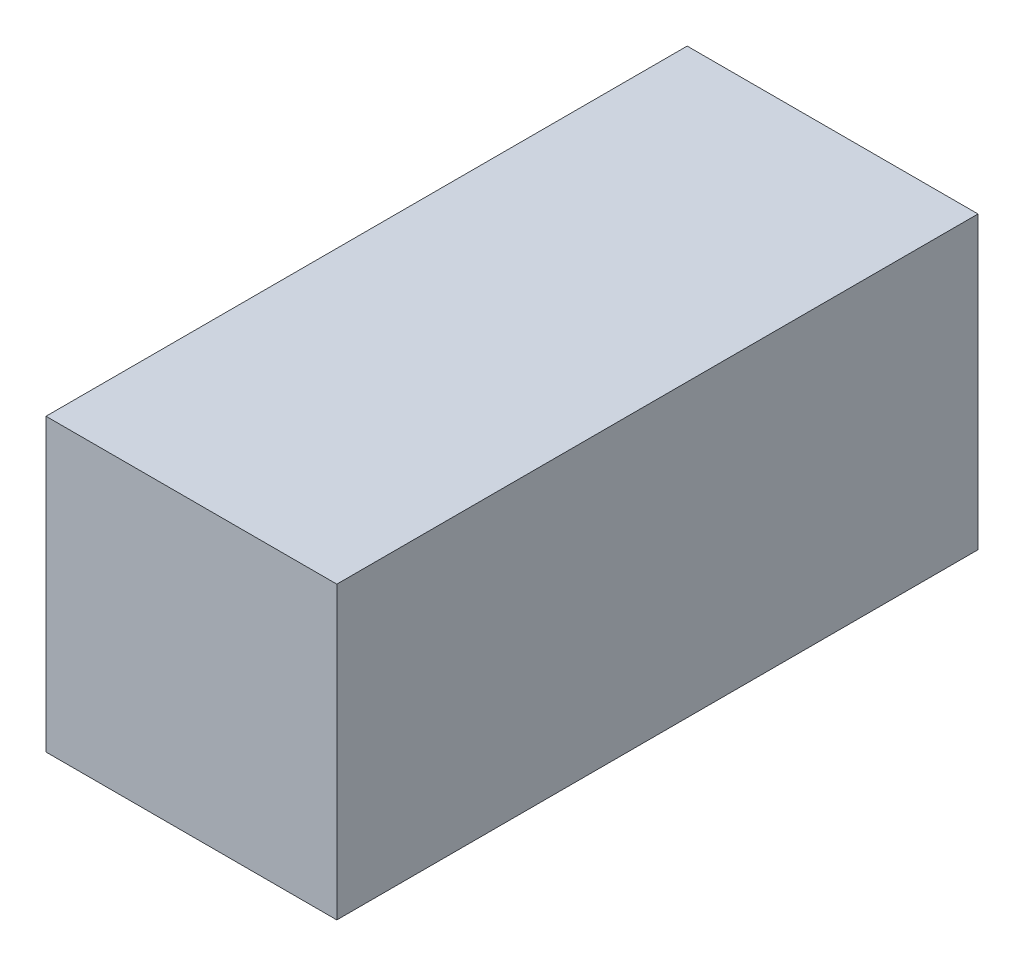
ISO-10303-21;
HEADER;
FILE_DESCRIPTION(('STEP AP214'),'2;1');
FILE_NAME('part.step','',(''),(''),'','','');
FILE_SCHEMA(('AUTOMOTIVE_DESIGN { 1 0 10303 214 1 1 1 1 }'));
ENDSEC;
DATA;
#1=APPLICATION_CONTEXT('core data for automotive mechanical design processes');
#2=APPLICATION_PROTOCOL_DEFINITION('international standard','automotive_design',2000,#1);
#3=PRODUCT_CONTEXT('',#1,'mechanical');
#4=PRODUCT('Part','Part','',(#3));
#5=PRODUCT_RELATED_PRODUCT_CATEGORY('part','',(#4));
#6=PRODUCT_DEFINITION_FORMATION('','',#4);
#7=PRODUCT_DEFINITION_CONTEXT('part definition',#1,'design');
#8=PRODUCT_DEFINITION('design','',#6,#7);
#9=PRODUCT_DEFINITION_SHAPE('','',#8);
#10=(LENGTH_UNIT() NAMED_UNIT(*) SI_UNIT(.MILLI.,.METRE.));
#11=(NAMED_UNIT(*) PLANE_ANGLE_UNIT() SI_UNIT($,.RADIAN.));
#12=(NAMED_UNIT(*) SI_UNIT($,.STERADIAN.) SOLID_ANGLE_UNIT());
#13=UNCERTAINTY_MEASURE_WITH_UNIT(LENGTH_MEASURE(1.E-05),#10,'distance_accuracy_value','');
#14=(GEOMETRIC_REPRESENTATION_CONTEXT(3) GLOBAL_UNCERTAINTY_ASSIGNED_CONTEXT((#13)) GLOBAL_UNIT_ASSIGNED_CONTEXT((#10,
#11,#12)) REPRESENTATION_CONTEXT('',''));
#15=CARTESIAN_POINT('',(0.,0.,0.));
#16=DIRECTION('',(0.,0.,1.));
#17=DIRECTION('',(1.,0.,0.));
#18=AXIS2_PLACEMENT_3D('',#15,#16,#17);
#19=CARTESIAN_POINT('',(0.,0.,140.));
#20=DIRECTION('',(0.,0.,1.));
#21=DIRECTION('',(1.,0.,0.));
#22=AXIS2_PLACEMENT_3D('',#19,#20,#21);
#23=PLANE('',#22);
#24=DIRECTION('',(0.,-1.,0.));
#25=VECTOR('',#24,1.);
#26=CARTESIAN_POINT('',(0.,0.,140.));
#27=LINE('',#26,#25);
#28=CARTESIAN_POINT('',(0.,0.,140.));
#29=VERTEX_POINT('',#28);
#30=CARTESIAN_POINT('',(0.,-63.5,140.));
#31=VERTEX_POINT('',#30);
#32=EDGE_CURVE('E132',#29,#31,#27,.T.);
#33=ORIENTED_EDGE('',*,*,#32,.T.);
#34=DIRECTION('',(1.,0.,0.));
#35=VECTOR('',#34,1.);
#36=CARTESIAN_POINT('',(0.,-63.5,140.));
#37=LINE('',#36,#35);
#38=CARTESIAN_POINT('',(63.5,-63.5,140.));
#39=VERTEX_POINT('',#38);
#40=EDGE_CURVE('E135',#31,#39,#37,.T.);
#41=ORIENTED_EDGE('',*,*,#40,.T.);
#42=DIRECTION('',(0.,1.,0.));
#43=VECTOR('',#42,1.);
#44=CARTESIAN_POINT('',(63.5,0.,140.));
#45=LINE('',#44,#43);
#46=CARTESIAN_POINT('',(63.5,0.,140.));
#47=VERTEX_POINT('',#46);
#48=EDGE_CURVE('E138',#39,#47,#45,.T.);
#49=ORIENTED_EDGE('',*,*,#48,.T.);
#50=DIRECTION('',(-1.,0.,0.));
#51=VECTOR('',#50,1.);
#52=CARTESIAN_POINT('',(0.,0.,140.));
#53=LINE('',#52,#51);
#54=EDGE_CURVE('E140',#47,#29,#53,.T.);
#55=ORIENTED_EDGE('',*,*,#54,.T.);
#56=EDGE_LOOP('',(#33,#41,#49,#55));
#57=FACE_BOUND('',#56,.T.);
#58=ADVANCED_FACE('F39',(#57),#23,.T.);
#59=CARTESIAN_POINT('',(0.,0.,0.));
#60=DIRECTION('',(0.,0.,1.));
#61=DIRECTION('',(1.,0.,0.));
#62=AXIS2_PLACEMENT_3D('',#59,#60,#61);
#63=PLANE('',#62);
#64=DIRECTION('',(0.,-1.,0.));
#65=VECTOR('',#64,1.);
#66=CARTESIAN_POINT('',(0.,0.,0.));
#67=LINE('',#66,#65);
#68=CARTESIAN_POINT('',(0.,0.,0.));
#69=VERTEX_POINT('',#68);
#70=CARTESIAN_POINT('',(0.,-63.5,0.));
#71=VERTEX_POINT('',#70);
#72=EDGE_CURVE('E126',#69,#71,#67,.T.);
#73=ORIENTED_EDGE('',*,*,#72,.F.);
#74=DIRECTION('',(-1.,0.,0.));
#75=VECTOR('',#74,1.);
#76=CARTESIAN_POINT('',(0.,0.,0.));
#77=LINE('',#76,#75);
#78=CARTESIAN_POINT('',(63.5,0.,0.));
#79=VERTEX_POINT('',#78);
#80=EDGE_CURVE('E136',#79,#69,#77,.T.);
#81=ORIENTED_EDGE('',*,*,#80,.F.);
#82=DIRECTION('',(0.,1.,0.));
#83=VECTOR('',#82,1.);
#84=CARTESIAN_POINT('',(63.5,0.,0.));
#85=LINE('',#84,#83);
#86=CARTESIAN_POINT('',(63.5,-63.5,0.));
#87=VERTEX_POINT('',#86);
#88=EDGE_CURVE('E147',#87,#79,#85,.T.);
#89=ORIENTED_EDGE('',*,*,#88,.F.);
#90=DIRECTION('',(1.,0.,0.));
#91=VECTOR('',#90,1.);
#92=CARTESIAN_POINT('',(0.,-63.5,0.));
#93=LINE('',#92,#91);
#94=EDGE_CURVE('E145',#71,#87,#93,.T.);
#95=ORIENTED_EDGE('',*,*,#94,.F.);
#96=EDGE_LOOP('',(#73,#81,#89,#95));
#97=FACE_BOUND('',#96,.T.);
#98=ADVANCED_FACE('F165',(#97),#63,.F.);
#99=CARTESIAN_POINT('',(0.,0.,140.));
#100=DIRECTION('',(1.,0.,0.));
#101=DIRECTION('',(0.,1.,0.));
#102=AXIS2_PLACEMENT_3D('',#99,#100,#101);
#103=PLANE('',#102);
#104=ORIENTED_EDGE('',*,*,#72,.T.);
#105=DIRECTION('',(0.,0.,-1.));
#106=VECTOR('',#105,1.);
#107=CARTESIAN_POINT('',(0.,-63.5,140.));
#108=LINE('',#107,#106);
#109=EDGE_CURVE('E11',#31,#71,#108,.T.);
#110=ORIENTED_EDGE('',*,*,#109,.F.);
#111=ORIENTED_EDGE('',*,*,#32,.F.);
#112=DIRECTION('',(0.,0.,-1.));
#113=VECTOR('',#112,1.);
#114=CARTESIAN_POINT('',(0.,0.,140.));
#115=LINE('',#114,#113);
#116=EDGE_CURVE('E142',#29,#69,#115,.T.);
#117=ORIENTED_EDGE('',*,*,#116,.T.);
#118=EDGE_LOOP('',(#104,#110,#111,#117));
#119=FACE_BOUND('',#118,.T.);
#120=ADVANCED_FACE('F41',(#119),#103,.F.);
#121=CARTESIAN_POINT('',(0.,-63.5,140.));
#122=DIRECTION('',(0.,1.,0.));
#123=DIRECTION('',(0.,0.,1.));
#124=AXIS2_PLACEMENT_3D('',#121,#122,#123);
#125=PLANE('',#124);
#126=ORIENTED_EDGE('',*,*,#94,.T.);
#127=DIRECTION('',(0.,0.,-1.));
#128=VECTOR('',#127,1.);
#129=CARTESIAN_POINT('',(63.5,-63.5,140.));
#130=LINE('',#129,#128);
#131=EDGE_CURVE('E48',#39,#87,#130,.T.);
#132=ORIENTED_EDGE('',*,*,#131,.F.);
#133=ORIENTED_EDGE('',*,*,#40,.F.);
#134=ORIENTED_EDGE('',*,*,#109,.T.);
#135=EDGE_LOOP('',(#126,#132,#133,#134));
#136=FACE_BOUND('',#135,.T.);
#137=ADVANCED_FACE('F174',(#136),#125,.F.);
#138=CARTESIAN_POINT('',(63.5,0.,140.));
#139=DIRECTION('',(-1.,0.,0.));
#140=DIRECTION('',(0.,-1.,0.));
#141=AXIS2_PLACEMENT_3D('',#138,#139,#140);
#142=PLANE('',#141);
#143=ORIENTED_EDGE('',*,*,#88,.T.);
#144=DIRECTION('',(0.,0.,-1.));
#145=VECTOR('',#144,1.);
#146=CARTESIAN_POINT('',(63.5,0.,140.));
#147=LINE('',#146,#145);
#148=EDGE_CURVE('E152',#47,#79,#147,.T.);
#149=ORIENTED_EDGE('',*,*,#148,.F.);
#150=ORIENTED_EDGE('',*,*,#48,.F.);
#151=ORIENTED_EDGE('',*,*,#131,.T.);
#152=EDGE_LOOP('',(#143,#149,#150,#151));
#153=FACE_BOUND('',#152,.T.);
#154=ADVANCED_FACE('F159',(#153),#142,.F.);
#155=CARTESIAN_POINT('',(0.,0.,140.));
#156=DIRECTION('',(0.,-1.,0.));
#157=DIRECTION('',(0.,0.,-1.));
#158=AXIS2_PLACEMENT_3D('',#155,#156,#157);
#159=PLANE('',#158);
#160=ORIENTED_EDGE('',*,*,#80,.T.);
#161=ORIENTED_EDGE('',*,*,#116,.F.);
#162=ORIENTED_EDGE('',*,*,#54,.F.);
#163=ORIENTED_EDGE('',*,*,#148,.T.);
#164=EDGE_LOOP('',(#160,#161,#162,#163));
#165=FACE_BOUND('',#164,.T.);
#166=ADVANCED_FACE('F168',(#165),#159,.F.);
#167=CLOSED_SHELL('',(#58,#98,#120,#137,#154,#166));
#168=CARTESIAN_POINT('',(0.,0.,1.9));
#169=DIRECTION('',(0.,0.,-1.));
#170=DIRECTION('',(-1.,0.,0.));
#171=AXIS2_PLACEMENT_3D('',#168,#169,#170);
#172=PLANE('',#171);
#173=DIRECTION('',(0.,-1.,0.));
#174=VECTOR('',#173,1.);
#175=CARTESIAN_POINT('',(61.6,-1.9,1.9));
#176=LINE('',#175,#174);
#177=CARTESIAN_POINT('',(61.6,-1.9,1.90000000000001));
#178=VERTEX_POINT('',#177);
#179=CARTESIAN_POINT('',(61.6,-61.6,1.9));
#180=VERTEX_POINT('',#179);
#181=EDGE_CURVE('E55',#178,#180,#176,.T.);
#182=ORIENTED_EDGE('',*,*,#181,.F.);
#183=DIRECTION('',(1.,0.,0.));
#184=VECTOR('',#183,1.);
#185=CARTESIAN_POINT('',(61.6,-1.9,1.9));
#186=LINE('',#185,#184);
#187=CARTESIAN_POINT('',(1.9,-1.9,1.9));
#188=VERTEX_POINT('',#187);
#189=EDGE_CURVE('E284',#188,#178,#186,.T.);
#190=ORIENTED_EDGE('',*,*,#189,.F.);
#191=DIRECTION('',(0.,1.,0.));
#192=VECTOR('',#191,1.);
#193=CARTESIAN_POINT('',(1.9,-1.9,1.9));
#194=LINE('',#193,#192);
#195=CARTESIAN_POINT('',(1.9,-61.6,1.9));
#196=VERTEX_POINT('',#195);
#197=EDGE_CURVE('E106',#196,#188,#194,.T.);
#198=ORIENTED_EDGE('',*,*,#197,.F.);
#199=DIRECTION('',(-1.,0.,0.));
#200=VECTOR('',#199,1.);
#201=CARTESIAN_POINT('',(61.6,-61.6,1.9));
#202=LINE('',#201,#200);
#203=EDGE_CURVE('E103',#180,#196,#202,.T.);
#204=ORIENTED_EDGE('',*,*,#203,.F.);
#205=EDGE_LOOP('',(#182,#190,#198,#204));
#206=FACE_BOUND('',#205,.T.);
#207=ADVANCED_FACE('F104',(#206),#172,.F.);
#208=CARTESIAN_POINT('',(0.,0.,138.1));
#209=DIRECTION('',(0.,0.,1.));
#210=DIRECTION('',(1.,0.,0.));
#211=AXIS2_PLACEMENT_3D('',#208,#209,#210);
#212=PLANE('',#211);
#213=DIRECTION('',(0.,-1.,0.));
#214=VECTOR('',#213,1.);
#215=CARTESIAN_POINT('',(1.9,-1.9,138.1));
#216=LINE('',#215,#214);
#217=CARTESIAN_POINT('',(1.9,-1.9,138.1));
#218=VERTEX_POINT('',#217);
#219=CARTESIAN_POINT('',(1.9,-61.6,138.1));
#220=VERTEX_POINT('',#219);
#221=EDGE_CURVE('E63',#218,#220,#216,.T.);
#222=ORIENTED_EDGE('',*,*,#221,.F.);
#223=DIRECTION('',(-1.,0.,0.));
#224=VECTOR('',#223,1.);
#225=CARTESIAN_POINT('',(1.9,-1.9,138.1));
#226=LINE('',#225,#224);
#227=CARTESIAN_POINT('',(61.6,-1.9,138.1));
#228=VERTEX_POINT('',#227);
#229=EDGE_CURVE('E292',#228,#218,#226,.T.);
#230=ORIENTED_EDGE('',*,*,#229,.F.);
#231=DIRECTION('',(0.,1.,0.));
#232=VECTOR('',#231,1.);
#233=CARTESIAN_POINT('',(61.6,-1.9,138.1));
#234=LINE('',#233,#232);
#235=CARTESIAN_POINT('',(61.6,-61.6,138.1));
#236=VERTEX_POINT('',#235);
#237=EDGE_CURVE('E286',#236,#228,#234,.T.);
#238=ORIENTED_EDGE('',*,*,#237,.F.);
#239=DIRECTION('',(1.,0.,0.));
#240=VECTOR('',#239,1.);
#241=CARTESIAN_POINT('',(1.9,-61.6,138.1));
#242=LINE('',#241,#240);
#243=EDGE_CURVE('E123',#220,#236,#242,.T.);
#244=ORIENTED_EDGE('',*,*,#243,.F.);
#245=EDGE_LOOP('',(#222,#230,#238,#244));
#246=FACE_BOUND('',#245,.T.);
#247=ADVANCED_FACE('F201',(#246),#212,.F.);
#248=CARTESIAN_POINT('',(1.9,-1.9,140.));
#249=DIRECTION('',(0.,-1.,0.));
#250=DIRECTION('',(0.,0.,-1.));
#251=AXIS2_PLACEMENT_3D('',#248,#249,#250);
#252=PLANE('',#251);
#253=DIRECTION('',(0.,0.,-1.));
#254=VECTOR('',#253,1.);
#255=CARTESIAN_POINT('',(1.9,-1.9,140.));
#256=LINE('',#255,#254);
#257=EDGE_CURVE('E128',#218,#188,#256,.T.);
#258=ORIENTED_EDGE('',*,*,#257,.T.);
#259=ORIENTED_EDGE('',*,*,#189,.T.);
#260=DIRECTION('',(0.,0.,-1.));
#261=VECTOR('',#260,1.);
#262=CARTESIAN_POINT('',(61.6,-1.9,140.));
#263=LINE('',#262,#261);
#264=EDGE_CURVE('E119',#228,#178,#263,.T.);
#265=ORIENTED_EDGE('',*,*,#264,.F.);
#266=ORIENTED_EDGE('',*,*,#229,.T.);
#267=EDGE_LOOP('',(#258,#259,#265,#266));
#268=FACE_BOUND('',#267,.T.);
#269=ADVANCED_FACE('F211',(#268),#252,.T.);
#270=CARTESIAN_POINT('',(61.6,-1.9,140.));
#271=DIRECTION('',(-1.,0.,0.));
#272=DIRECTION('',(0.,0.,1.));
#273=AXIS2_PLACEMENT_3D('',#270,#271,#272);
#274=PLANE('',#273);
#275=ORIENTED_EDGE('',*,*,#264,.T.);
#276=ORIENTED_EDGE('',*,*,#181,.T.);
#277=DIRECTION('',(0.,0.,-1.));
#278=VECTOR('',#277,1.);
#279=CARTESIAN_POINT('',(61.6,-61.6,140.));
#280=LINE('',#279,#278);
#281=EDGE_CURVE('E117',#236,#180,#280,.T.);
#282=ORIENTED_EDGE('',*,*,#281,.F.);
#283=ORIENTED_EDGE('',*,*,#237,.T.);
#284=EDGE_LOOP('',(#275,#276,#282,#283));
#285=FACE_BOUND('',#284,.T.);
#286=ADVANCED_FACE('F115',(#285),#274,.T.);
#287=CARTESIAN_POINT('',(1.9,-61.6,140.));
#288=DIRECTION('',(0.,1.,0.));
#289=DIRECTION('',(0.,0.,1.));
#290=AXIS2_PLACEMENT_3D('',#287,#288,#289);
#291=PLANE('',#290);
#292=ORIENTED_EDGE('',*,*,#281,.T.);
#293=ORIENTED_EDGE('',*,*,#203,.T.);
#294=DIRECTION('',(0.,0.,-1.));
#295=VECTOR('',#294,1.);
#296=CARTESIAN_POINT('',(1.9,-61.6,140.));
#297=LINE('',#296,#295);
#298=EDGE_CURVE('E124',#220,#196,#297,.T.);
#299=ORIENTED_EDGE('',*,*,#298,.F.);
#300=ORIENTED_EDGE('',*,*,#243,.T.);
#301=EDGE_LOOP('',(#292,#293,#299,#300));
#302=FACE_BOUND('',#301,.T.);
#303=ADVANCED_FACE('F122',(#302),#291,.T.);
#304=CARTESIAN_POINT('',(1.9,-1.9,140.));
#305=DIRECTION('',(1.,0.,0.));
#306=DIRECTION('',(0.,0.,-1.));
#307=AXIS2_PLACEMENT_3D('',#304,#305,#306);
#308=PLANE('',#307);
#309=ORIENTED_EDGE('',*,*,#298,.T.);
#310=ORIENTED_EDGE('',*,*,#197,.T.);
#311=ORIENTED_EDGE('',*,*,#257,.F.);
#312=ORIENTED_EDGE('',*,*,#221,.T.);
#313=EDGE_LOOP('',(#309,#310,#311,#312));
#314=FACE_BOUND('',#313,.T.);
#315=ADVANCED_FACE('F188',(#314),#308,.T.);
#316=CLOSED_SHELL('',(#207,#247,#269,#286,#303,#315));
#317=ORIENTED_CLOSED_SHELL('',*,#316,.T.);
#318=BREP_WITH_VOIDS('B2',#167,(#317));
#319=ADVANCED_BREP_SHAPE_REPRESENTATION('',(#18,#318),#14);
#320=SHAPE_DEFINITION_REPRESENTATION(#9,#319);
ENDSEC;
END-ISO-10303-21;
